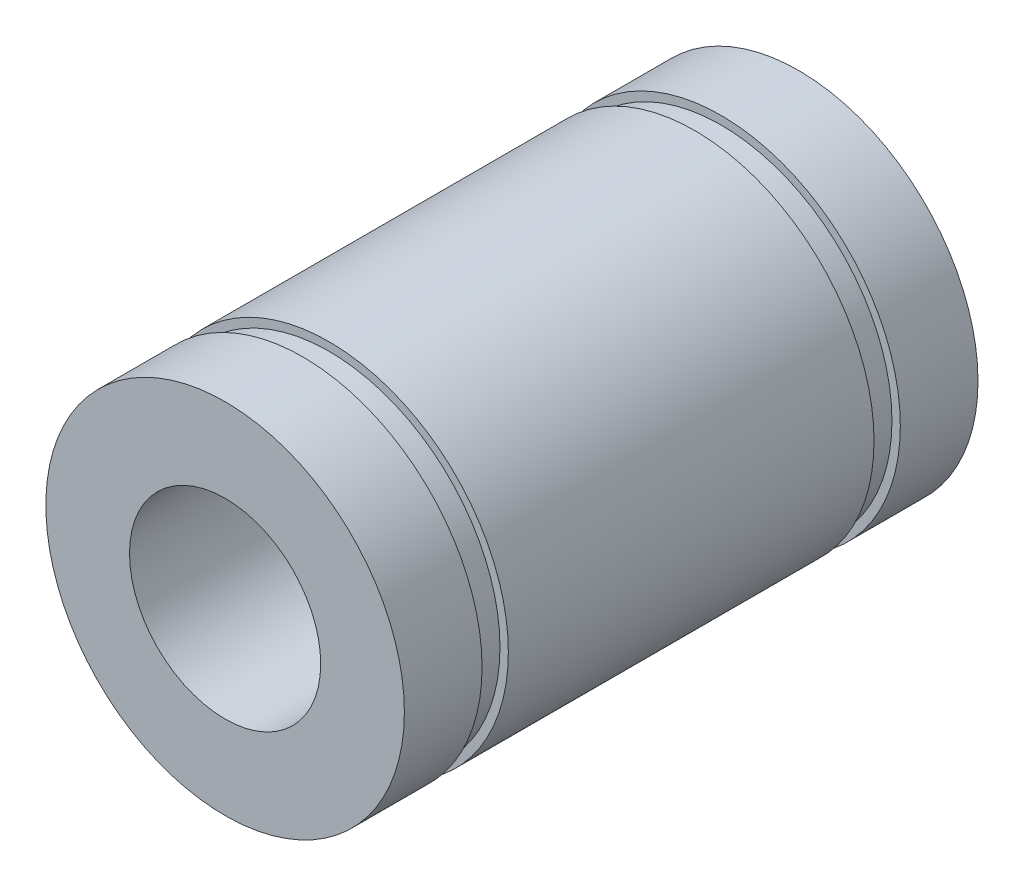
ISO-10303-21;
HEADER;
FILE_DESCRIPTION(('STEP AP214'),'2;1');
FILE_NAME('part.step','',(''),(''),'','','');
FILE_SCHEMA(('AUTOMOTIVE_DESIGN { 1 0 10303 214 1 1 1 1 }'));
ENDSEC;
DATA;
#1=APPLICATION_CONTEXT('core data for automotive mechanical design processes');
#2=APPLICATION_PROTOCOL_DEFINITION('international standard','automotive_design',2000,#1);
#3=PRODUCT_CONTEXT('',#1,'mechanical');
#4=PRODUCT('Part','Part','',(#3));
#5=PRODUCT_RELATED_PRODUCT_CATEGORY('part','',(#4));
#6=PRODUCT_DEFINITION_FORMATION('','',#4);
#7=PRODUCT_DEFINITION_CONTEXT('part definition',#1,'design');
#8=PRODUCT_DEFINITION('design','',#6,#7);
#9=PRODUCT_DEFINITION_SHAPE('','',#8);
#10=(LENGTH_UNIT() NAMED_UNIT(*) SI_UNIT(.MILLI.,.METRE.));
#11=(NAMED_UNIT(*) PLANE_ANGLE_UNIT() SI_UNIT($,.RADIAN.));
#12=(NAMED_UNIT(*) SI_UNIT($,.STERADIAN.) SOLID_ANGLE_UNIT());
#13=UNCERTAINTY_MEASURE_WITH_UNIT(LENGTH_MEASURE(1.E-05),#10,'distance_accuracy_value','');
#14=(GEOMETRIC_REPRESENTATION_CONTEXT(3) GLOBAL_UNCERTAINTY_ASSIGNED_CONTEXT((#13)) GLOBAL_UNIT_ASSIGNED_CONTEXT((#10,
#11,#12)) REPRESENTATION_CONTEXT('',''));
#15=CARTESIAN_POINT('',(0.,0.,0.));
#16=DIRECTION('',(0.,0.,1.));
#17=DIRECTION('',(1.,0.,0.));
#18=AXIS2_PLACEMENT_3D('',#15,#16,#17);
#19=CARTESIAN_POINT('',(0.,0.,0.));
#20=DIRECTION('',(0.,0.,1.));
#21=DIRECTION('',(1.,0.,0.));
#22=AXIS2_PLACEMENT_3D('',#19,#20,#21);
#23=CYLINDRICAL_SURFACE('',#22,7.5);
#24=CARTESIAN_POINT('',(0.,0.,0.));
#25=DIRECTION('',(0.,0.,1.));
#26=DIRECTION('',(1.,0.,0.));
#27=AXIS2_PLACEMENT_3D('',#24,#25,#26);
#28=CIRCLE('',#27,7.5);
#29=CARTESIAN_POINT('',(7.5,0.,0.));
#30=VERTEX_POINT('',#29);
#31=EDGE_CURVE('E10',#30,#30,#28,.T.);
#32=ORIENTED_EDGE('',*,*,#31,.T.);
#33=EDGE_LOOP('',(#32));
#34=FACE_BOUND('',#33,.T.);
#35=CARTESIAN_POINT('',(0.,0.,3.25));
#36=DIRECTION('',(0.,0.,1.));
#37=DIRECTION('',(1.,0.,0.));
#38=AXIS2_PLACEMENT_3D('',#35,#36,#37);
#39=CIRCLE('',#38,7.5);
#40=CARTESIAN_POINT('',(7.5,0.,3.25));
#41=VERTEX_POINT('',#40);
#42=EDGE_CURVE('E71',#41,#41,#39,.T.);
#43=ORIENTED_EDGE('',*,*,#42,.F.);
#44=EDGE_LOOP('',(#43));
#45=FACE_BOUND('',#44,.T.);
#46=ADVANCED_FACE('F31',(#34,#45),#23,.T.);
#47=CARTESIAN_POINT('',(7.5,0.,0.));
#48=DIRECTION('',(0.,0.,-1.));
#49=DIRECTION('',(-1.,0.,0.));
#50=AXIS2_PLACEMENT_3D('',#47,#48,#49);
#51=PLANE('',#50);
#52=CARTESIAN_POINT('',(0.,0.,0.));
#53=DIRECTION('',(0.,0.,1.));
#54=DIRECTION('',(1.,0.,0.));
#55=AXIS2_PLACEMENT_3D('',#52,#53,#54);
#56=CIRCLE('',#55,4.);
#57=CARTESIAN_POINT('',(4.,0.,0.));
#58=VERTEX_POINT('',#57);
#59=EDGE_CURVE('E37',#58,#58,#56,.T.);
#60=ORIENTED_EDGE('',*,*,#59,.T.);
#61=EDGE_LOOP('',(#60));
#62=FACE_BOUND('',#61,.T.);
#63=ORIENTED_EDGE('',*,*,#31,.F.);
#64=EDGE_LOOP('',(#63));
#65=FACE_BOUND('',#64,.T.);
#66=ADVANCED_FACE('F79',(#62,#65),#51,.T.);
#67=CARTESIAN_POINT('',(0.,0.,0.));
#68=DIRECTION('',(0.,0.,1.));
#69=DIRECTION('',(1.,0.,0.));
#70=AXIS2_PLACEMENT_3D('',#67,#68,#69);
#71=CYLINDRICAL_SURFACE('',#70,4.);
#72=CARTESIAN_POINT('',(0.,0.,24.));
#73=DIRECTION('',(0.,0.,1.));
#74=DIRECTION('',(1.,0.,0.));
#75=AXIS2_PLACEMENT_3D('',#72,#73,#74);
#76=CIRCLE('',#75,4.);
#77=CARTESIAN_POINT('',(4.,0.,24.));
#78=VERTEX_POINT('',#77);
#79=EDGE_CURVE('E41',#78,#78,#76,.T.);
#80=ORIENTED_EDGE('',*,*,#79,.T.);
#81=EDGE_LOOP('',(#80));
#82=FACE_BOUND('',#81,.T.);
#83=ORIENTED_EDGE('',*,*,#59,.F.);
#84=EDGE_LOOP('',(#83));
#85=FACE_BOUND('',#84,.T.);
#86=ADVANCED_FACE('F83',(#82,#85),#71,.F.);
#87=CARTESIAN_POINT('',(4.,0.,24.));
#88=DIRECTION('',(0.,0.,1.));
#89=DIRECTION('',(1.,0.,0.));
#90=AXIS2_PLACEMENT_3D('',#87,#88,#89);
#91=PLANE('',#90);
#92=CARTESIAN_POINT('',(0.,0.,24.));
#93=DIRECTION('',(0.,0.,1.));
#94=DIRECTION('',(1.,0.,0.));
#95=AXIS2_PLACEMENT_3D('',#92,#93,#94);
#96=CIRCLE('',#95,7.5);
#97=CARTESIAN_POINT('',(7.5,0.,24.));
#98=VERTEX_POINT('',#97);
#99=EDGE_CURVE('E45',#98,#98,#96,.T.);
#100=ORIENTED_EDGE('',*,*,#99,.T.);
#101=EDGE_LOOP('',(#100));
#102=FACE_BOUND('',#101,.T.);
#103=ORIENTED_EDGE('',*,*,#79,.F.);
#104=EDGE_LOOP('',(#103));
#105=FACE_BOUND('',#104,.T.);
#106=ADVANCED_FACE('F87',(#102,#105),#91,.T.);
#107=CARTESIAN_POINT('',(0.,0.,0.));
#108=DIRECTION('',(0.,0.,1.));
#109=DIRECTION('',(1.,0.,0.));
#110=AXIS2_PLACEMENT_3D('',#107,#108,#109);
#111=CYLINDRICAL_SURFACE('',#110,7.5);
#112=CARTESIAN_POINT('',(0.,0.,20.75));
#113=DIRECTION('',(0.,0.,1.));
#114=DIRECTION('',(1.,0.,0.));
#115=AXIS2_PLACEMENT_3D('',#112,#113,#114);
#116=CIRCLE('',#115,7.5);
#117=CARTESIAN_POINT('',(7.5,0.,20.75));
#118=VERTEX_POINT('',#117);
#119=EDGE_CURVE('E50',#118,#118,#116,.T.);
#120=ORIENTED_EDGE('',*,*,#119,.T.);
#121=EDGE_LOOP('',(#120));
#122=FACE_BOUND('',#121,.T.);
#123=ORIENTED_EDGE('',*,*,#99,.F.);
#124=EDGE_LOOP('',(#123));
#125=FACE_BOUND('',#124,.T.);
#126=ADVANCED_FACE('F94',(#122,#125),#111,.T.);
#127=CARTESIAN_POINT('',(7.5,0.,20.75));
#128=DIRECTION('',(0.,0.,-1.));
#129=DIRECTION('',(-1.,0.,0.));
#130=AXIS2_PLACEMENT_3D('',#127,#128,#129);
#131=PLANE('',#130);
#132=CARTESIAN_POINT('',(0.,0.,20.75));
#133=DIRECTION('',(0.,0.,1.));
#134=DIRECTION('',(1.,0.,0.));
#135=AXIS2_PLACEMENT_3D('',#132,#133,#134);
#136=CIRCLE('',#135,7.15);
#137=CARTESIAN_POINT('',(7.15,0.,20.75));
#138=VERTEX_POINT('',#137);
#139=EDGE_CURVE('E53',#138,#138,#136,.T.);
#140=ORIENTED_EDGE('',*,*,#139,.T.);
#141=EDGE_LOOP('',(#140));
#142=FACE_BOUND('',#141,.T.);
#143=ORIENTED_EDGE('',*,*,#119,.F.);
#144=EDGE_LOOP('',(#143));
#145=FACE_BOUND('',#144,.T.);
#146=ADVANCED_FACE('F98',(#142,#145),#131,.T.);
#147=CARTESIAN_POINT('',(0.,0.,0.));
#148=DIRECTION('',(0.,0.,1.));
#149=DIRECTION('',(1.,0.,0.));
#150=AXIS2_PLACEMENT_3D('',#147,#148,#149);
#151=CYLINDRICAL_SURFACE('',#150,7.15);
#152=CARTESIAN_POINT('',(0.,0.,19.65));
#153=DIRECTION('',(0.,0.,1.));
#154=DIRECTION('',(1.,0.,0.));
#155=AXIS2_PLACEMENT_3D('',#152,#153,#154);
#156=CIRCLE('',#155,7.15);
#157=CARTESIAN_POINT('',(7.15,0.,19.65));
#158=VERTEX_POINT('',#157);
#159=EDGE_CURVE('E56',#158,#158,#156,.T.);
#160=ORIENTED_EDGE('',*,*,#159,.T.);
#161=EDGE_LOOP('',(#160));
#162=FACE_BOUND('',#161,.T.);
#163=ORIENTED_EDGE('',*,*,#139,.F.);
#164=EDGE_LOOP('',(#163));
#165=FACE_BOUND('',#164,.T.);
#166=ADVANCED_FACE('F102',(#162,#165),#151,.T.);
#167=CARTESIAN_POINT('',(7.15,0.,19.65));
#168=DIRECTION('',(0.,0.,1.));
#169=DIRECTION('',(1.,0.,0.));
#170=AXIS2_PLACEMENT_3D('',#167,#168,#169);
#171=PLANE('',#170);
#172=CARTESIAN_POINT('',(0.,0.,19.65));
#173=DIRECTION('',(0.,0.,1.));
#174=DIRECTION('',(1.,0.,0.));
#175=AXIS2_PLACEMENT_3D('',#172,#173,#174);
#176=CIRCLE('',#175,7.5);
#177=CARTESIAN_POINT('',(7.5,0.,19.65));
#178=VERTEX_POINT('',#177);
#179=EDGE_CURVE('E59',#178,#178,#176,.T.);
#180=ORIENTED_EDGE('',*,*,#179,.T.);
#181=EDGE_LOOP('',(#180));
#182=FACE_BOUND('',#181,.T.);
#183=ORIENTED_EDGE('',*,*,#159,.F.);
#184=EDGE_LOOP('',(#183));
#185=FACE_BOUND('',#184,.T.);
#186=ADVANCED_FACE('F106',(#182,#185),#171,.T.);
#187=CARTESIAN_POINT('',(0.,0.,0.));
#188=DIRECTION('',(0.,0.,1.));
#189=DIRECTION('',(1.,0.,0.));
#190=AXIS2_PLACEMENT_3D('',#187,#188,#189);
#191=CYLINDRICAL_SURFACE('',#190,7.5);
#192=CARTESIAN_POINT('',(0.,0.,4.35));
#193=DIRECTION('',(0.,0.,1.));
#194=DIRECTION('',(1.,0.,0.));
#195=AXIS2_PLACEMENT_3D('',#192,#193,#194);
#196=CIRCLE('',#195,7.5);
#197=CARTESIAN_POINT('',(7.5,0.,4.35));
#198=VERTEX_POINT('',#197);
#199=EDGE_CURVE('E62',#198,#198,#196,.T.);
#200=ORIENTED_EDGE('',*,*,#199,.T.);
#201=EDGE_LOOP('',(#200));
#202=FACE_BOUND('',#201,.T.);
#203=ORIENTED_EDGE('',*,*,#179,.F.);
#204=EDGE_LOOP('',(#203));
#205=FACE_BOUND('',#204,.T.);
#206=ADVANCED_FACE('F110',(#202,#205),#191,.T.);
#207=CARTESIAN_POINT('',(7.5,0.,4.35));
#208=DIRECTION('',(0.,0.,-1.));
#209=DIRECTION('',(-1.,0.,0.));
#210=AXIS2_PLACEMENT_3D('',#207,#208,#209);
#211=PLANE('',#210);
#212=CARTESIAN_POINT('',(0.,0.,4.35));
#213=DIRECTION('',(0.,0.,1.));
#214=DIRECTION('',(1.,0.,0.));
#215=AXIS2_PLACEMENT_3D('',#212,#213,#214);
#216=CIRCLE('',#215,7.15);
#217=CARTESIAN_POINT('',(7.15,0.,4.35));
#218=VERTEX_POINT('',#217);
#219=EDGE_CURVE('E65',#218,#218,#216,.T.);
#220=ORIENTED_EDGE('',*,*,#219,.T.);
#221=EDGE_LOOP('',(#220));
#222=FACE_BOUND('',#221,.T.);
#223=ORIENTED_EDGE('',*,*,#199,.F.);
#224=EDGE_LOOP('',(#223));
#225=FACE_BOUND('',#224,.T.);
#226=ADVANCED_FACE('F114',(#222,#225),#211,.T.);
#227=CARTESIAN_POINT('',(0.,0.,0.));
#228=DIRECTION('',(0.,0.,1.));
#229=DIRECTION('',(1.,0.,0.));
#230=AXIS2_PLACEMENT_3D('',#227,#228,#229);
#231=CYLINDRICAL_SURFACE('',#230,7.15);
#232=CARTESIAN_POINT('',(0.,0.,3.25));
#233=DIRECTION('',(0.,0.,1.));
#234=DIRECTION('',(1.,0.,0.));
#235=AXIS2_PLACEMENT_3D('',#232,#233,#234);
#236=CIRCLE('',#235,7.15);
#237=CARTESIAN_POINT('',(7.15,0.,3.25));
#238=VERTEX_POINT('',#237);
#239=EDGE_CURVE('E68',#238,#238,#236,.T.);
#240=ORIENTED_EDGE('',*,*,#239,.T.);
#241=EDGE_LOOP('',(#240));
#242=FACE_BOUND('',#241,.T.);
#243=ORIENTED_EDGE('',*,*,#219,.F.);
#244=EDGE_LOOP('',(#243));
#245=FACE_BOUND('',#244,.T.);
#246=ADVANCED_FACE('F118',(#242,#245),#231,.T.);
#247=CARTESIAN_POINT('',(7.15,0.,3.25));
#248=DIRECTION('',(0.,0.,1.));
#249=DIRECTION('',(1.,0.,0.));
#250=AXIS2_PLACEMENT_3D('',#247,#248,#249);
#251=PLANE('',#250);
#252=ORIENTED_EDGE('',*,*,#42,.T.);
#253=EDGE_LOOP('',(#252));
#254=FACE_BOUND('',#253,.T.);
#255=ORIENTED_EDGE('',*,*,#239,.F.);
#256=EDGE_LOOP('',(#255));
#257=FACE_BOUND('',#256,.T.);
#258=ADVANCED_FACE('F75',(#254,#257),#251,.T.);
#259=CLOSED_SHELL('',(#46,#66,#86,#106,#126,#146,#166,#186,#206,#226,#246,#258));
#260=MANIFOLD_SOLID_BREP('B2',#259);
#261=ADVANCED_BREP_SHAPE_REPRESENTATION('',(#18,#260),#14);
#262=SHAPE_DEFINITION_REPRESENTATION(#9,#261);
ENDSEC;
END-ISO-10303-21;
